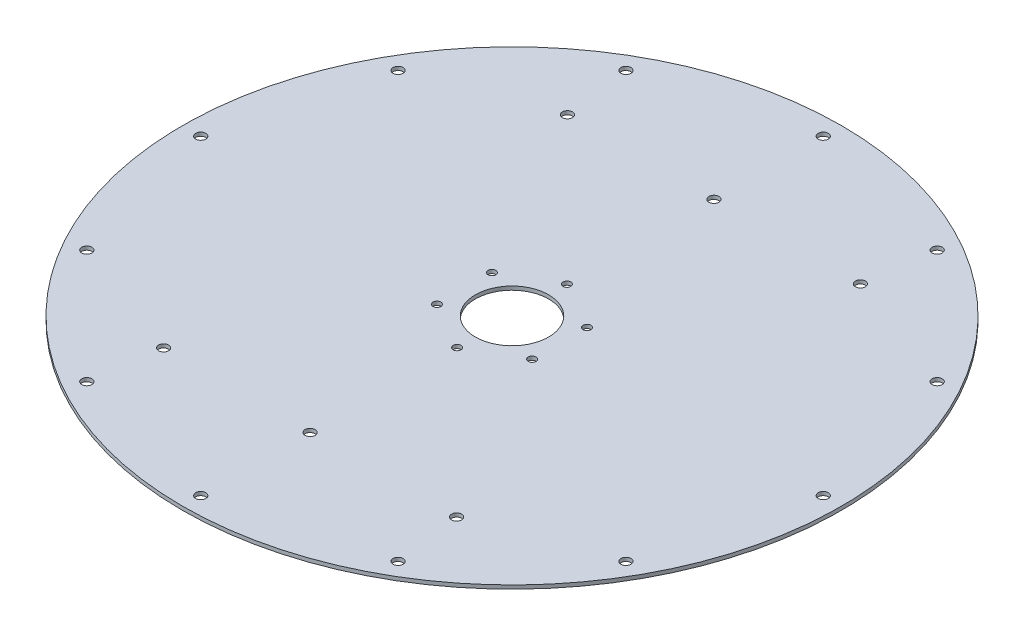
ISO-10303-21;
HEADER;
FILE_DESCRIPTION(('STEP AP214'),'2;1');
FILE_NAME('part.step','',(''),(''),'','','');
FILE_SCHEMA(('AUTOMOTIVE_DESIGN { 1 0 10303 214 1 1 1 1 }'));
ENDSEC;
DATA;
#1=APPLICATION_CONTEXT('core data for automotive mechanical design processes');
#2=APPLICATION_PROTOCOL_DEFINITION('international standard','automotive_design',2000,#1);
#3=PRODUCT_CONTEXT('',#1,'mechanical');
#4=PRODUCT('Part','Part','',(#3));
#5=PRODUCT_RELATED_PRODUCT_CATEGORY('part','',(#4));
#6=PRODUCT_DEFINITION_FORMATION('','',#4);
#7=PRODUCT_DEFINITION_CONTEXT('part definition',#1,'design');
#8=PRODUCT_DEFINITION('design','',#6,#7);
#9=PRODUCT_DEFINITION_SHAPE('','',#8);
#10=(LENGTH_UNIT() NAMED_UNIT(*) SI_UNIT(.MILLI.,.METRE.));
#11=(NAMED_UNIT(*) PLANE_ANGLE_UNIT() SI_UNIT($,.RADIAN.));
#12=(NAMED_UNIT(*) SI_UNIT($,.STERADIAN.) SOLID_ANGLE_UNIT());
#13=UNCERTAINTY_MEASURE_WITH_UNIT(LENGTH_MEASURE(1.E-05),#10,'distance_accuracy_value','');
#14=(GEOMETRIC_REPRESENTATION_CONTEXT(3) GLOBAL_UNCERTAINTY_ASSIGNED_CONTEXT((#13)) GLOBAL_UNIT_ASSIGNED_CONTEXT((#10,
#11,#12)) REPRESENTATION_CONTEXT('',''));
#15=CARTESIAN_POINT('',(0.,0.,0.));
#16=DIRECTION('',(0.,0.,1.));
#17=DIRECTION('',(1.,0.,0.));
#18=AXIS2_PLACEMENT_3D('',#15,#16,#17);
#19=CARTESIAN_POINT('',(0.,3265.99999999999,0.));
#20=DIRECTION('',(0.,1.,0.));
#21=DIRECTION('',(0.,0.,1.));
#22=AXIS2_PLACEMENT_3D('',#19,#20,#21);
#23=PLANE('',#22);
#24=CARTESIAN_POINT('',(-51.9615242270663,3265.99999999999,-30.));
#25=DIRECTION('',(0.,1.,0.));
#26=DIRECTION('',(0.,0.,1.));
#27=AXIS2_PLACEMENT_3D('',#24,#25,#26);
#28=CIRCLE('',#27,4.25);
#29=CARTESIAN_POINT('',(-51.9615242270663,3265.99999999999,-25.75));
#30=VERTEX_POINT('',#29);
#31=EDGE_CURVE('E125',#30,#30,#28,.T.);
#32=ORIENTED_EDGE('',*,*,#31,.F.);
#33=EDGE_LOOP('',(#32));
#34=FACE_BOUND('',#33,.T.);
#35=CARTESIAN_POINT('',(-51.9615242270663,3265.99999999999,30.));
#36=DIRECTION('',(0.,1.,0.));
#37=DIRECTION('',(0.,0.,1.));
#38=AXIS2_PLACEMENT_3D('',#35,#36,#37);
#39=CIRCLE('',#38,4.25);
#40=CARTESIAN_POINT('',(-51.9615242270663,3265.99999999999,34.25));
#41=VERTEX_POINT('',#40);
#42=EDGE_CURVE('E115',#41,#41,#39,.T.);
#43=ORIENTED_EDGE('',*,*,#42,.F.);
#44=EDGE_LOOP('',(#43));
#45=FACE_BOUND('',#44,.T.);
#46=CARTESIAN_POINT('',(0.,3265.99999999999,60.));
#47=DIRECTION('',(0.,1.,0.));
#48=DIRECTION('',(0.,0.,1.));
#49=AXIS2_PLACEMENT_3D('',#46,#47,#48);
#50=CIRCLE('',#49,4.25);
#51=CARTESIAN_POINT('',(0.,3265.99999999999,64.25));
#52=VERTEX_POINT('',#51);
#53=EDGE_CURVE('E112',#52,#52,#50,.T.);
#54=ORIENTED_EDGE('',*,*,#53,.F.);
#55=EDGE_LOOP('',(#54));
#56=FACE_BOUND('',#55,.T.);
#57=CARTESIAN_POINT('',(51.9615242270663,3265.99999999999,30.));
#58=DIRECTION('',(0.,1.,0.));
#59=DIRECTION('',(0.,0.,1.));
#60=AXIS2_PLACEMENT_3D('',#57,#58,#59);
#61=CIRCLE('',#60,4.25);
#62=CARTESIAN_POINT('',(51.9615242270663,3265.99999999999,34.25));
#63=VERTEX_POINT('',#62);
#64=EDGE_CURVE('E109',#63,#63,#61,.T.);
#65=ORIENTED_EDGE('',*,*,#64,.F.);
#66=EDGE_LOOP('',(#65));
#67=FACE_BOUND('',#66,.T.);
#68=CARTESIAN_POINT('',(51.9615242270663,3265.99999999999,-30.));
#69=DIRECTION('',(0.,1.,0.));
#70=DIRECTION('',(0.,0.,1.));
#71=AXIS2_PLACEMENT_3D('',#68,#69,#70);
#72=CIRCLE('',#71,4.25);
#73=CARTESIAN_POINT('',(51.9615242270663,3265.99999999999,-25.75));
#74=VERTEX_POINT('',#73);
#75=EDGE_CURVE('E105',#74,#74,#72,.T.);
#76=ORIENTED_EDGE('',*,*,#75,.F.);
#77=EDGE_LOOP('',(#76));
#78=FACE_BOUND('',#77,.T.);
#79=CARTESIAN_POINT('',(0.,3265.99999999999,-60.));
#80=DIRECTION('',(0.,1.,0.));
#81=DIRECTION('',(0.,0.,1.));
#82=AXIS2_PLACEMENT_3D('',#79,#80,#81);
#83=CIRCLE('',#82,4.25);
#84=CARTESIAN_POINT('',(0.,3265.99999999999,-55.75));
#85=VERTEX_POINT('',#84);
#86=EDGE_CURVE('E101',#85,#85,#83,.T.);
#87=ORIENTED_EDGE('',*,*,#86,.F.);
#88=EDGE_LOOP('',(#87));
#89=FACE_BOUND('',#88,.T.);
#90=CARTESIAN_POINT('',(0.,3265.99999999999,0.));
#91=DIRECTION('',(0.,1.,0.));
#92=DIRECTION('',(0.,0.,1.));
#93=AXIS2_PLACEMENT_3D('',#90,#91,#92);
#94=CIRCLE('',#93,40.);
#95=CARTESIAN_POINT('',(0.,3265.99999999999,40.));
#96=VERTEX_POINT('',#95);
#97=EDGE_CURVE('E97',#96,#96,#94,.T.);
#98=ORIENTED_EDGE('',*,*,#97,.F.);
#99=EDGE_LOOP('',(#98));
#100=FACE_BOUND('',#99,.T.);
#101=CARTESIAN_POINT('',(-160.,3265.99999999999,220.54150764194));
#102=DIRECTION('',(0.,1.,0.));
#103=DIRECTION('',(0.,0.,1.));
#104=AXIS2_PLACEMENT_3D('',#101,#102,#103);
#105=CIRCLE('',#104,5.50000000000002);
#106=CARTESIAN_POINT('',(-160.,3265.99999999999,226.04150764194));
#107=VERTEX_POINT('',#106);
#108=EDGE_CURVE('E94',#107,#107,#105,.T.);
#109=ORIENTED_EDGE('',*,*,#108,.F.);
#110=EDGE_LOOP('',(#109));
#111=FACE_BOUND('',#110,.T.);
#112=CARTESIAN_POINT('',(0.,3265.99999999999,220.54150764194));
#113=DIRECTION('',(0.,1.,0.));
#114=DIRECTION('',(0.,0.,1.));
#115=AXIS2_PLACEMENT_3D('',#112,#113,#114);
#116=CIRCLE('',#115,5.5);
#117=CARTESIAN_POINT('',(0.,3265.99999999999,226.04150764194));
#118=VERTEX_POINT('',#117);
#119=EDGE_CURVE('E90',#118,#118,#116,.T.);
#120=ORIENTED_EDGE('',*,*,#119,.F.);
#121=EDGE_LOOP('',(#120));
#122=FACE_BOUND('',#121,.T.);
#123=CARTESIAN_POINT('',(160.,3265.99999999999,220.54150764194));
#124=DIRECTION('',(0.,1.,0.));
#125=DIRECTION('',(0.,0.,1.));
#126=AXIS2_PLACEMENT_3D('',#123,#124,#125);
#127=CIRCLE('',#126,5.50000000000002);
#128=CARTESIAN_POINT('',(160.,3265.99999999999,226.04150764194));
#129=VERTEX_POINT('',#128);
#130=EDGE_CURVE('E86',#129,#129,#127,.T.);
#131=ORIENTED_EDGE('',*,*,#130,.F.);
#132=EDGE_LOOP('',(#131));
#133=FACE_BOUND('',#132,.T.);
#134=CARTESIAN_POINT('',(160.,3265.99999999999,-220.54150764194));
#135=DIRECTION('',(0.,1.,0.));
#136=DIRECTION('',(0.,0.,1.));
#137=AXIS2_PLACEMENT_3D('',#134,#135,#136);
#138=CIRCLE('',#137,5.50000000000002);
#139=CARTESIAN_POINT('',(160.,3265.99999999999,-215.04150764194));
#140=VERTEX_POINT('',#139);
#141=EDGE_CURVE('E82',#140,#140,#138,.T.);
#142=ORIENTED_EDGE('',*,*,#141,.F.);
#143=EDGE_LOOP('',(#142));
#144=FACE_BOUND('',#143,.T.);
#145=CARTESIAN_POINT('',(0.,3265.99999999999,-220.54150764194));
#146=DIRECTION('',(0.,1.,0.));
#147=DIRECTION('',(0.,0.,1.));
#148=AXIS2_PLACEMENT_3D('',#145,#146,#147);
#149=CIRCLE('',#148,5.5);
#150=CARTESIAN_POINT('',(0.,3265.99999999999,-215.04150764194));
#151=VERTEX_POINT('',#150);
#152=EDGE_CURVE('E78',#151,#151,#149,.T.);
#153=ORIENTED_EDGE('',*,*,#152,.F.);
#154=EDGE_LOOP('',(#153));
#155=FACE_BOUND('',#154,.T.);
#156=CARTESIAN_POINT('',(-160.,3265.99999999999,-220.54150764194));
#157=DIRECTION('',(0.,1.,0.));
#158=DIRECTION('',(0.,0.,1.));
#159=AXIS2_PLACEMENT_3D('',#156,#157,#158);
#160=CIRCLE('',#159,5.50000000000002);
#161=CARTESIAN_POINT('',(-160.,3265.99999999999,-215.04150764194));
#162=VERTEX_POINT('',#161);
#163=EDGE_CURVE('E73',#162,#162,#160,.T.);
#164=ORIENTED_EDGE('',*,*,#163,.F.);
#165=EDGE_LOOP('',(#164));
#166=FACE_BOUND('',#165,.T.);
#167=CARTESIAN_POINT('',(170.,3265.99999999999,294.448637286709));
#168=DIRECTION('',(0.,1.,0.));
#169=DIRECTION('',(0.,0.,1.));
#170=AXIS2_PLACEMENT_3D('',#167,#168,#169);
#171=CIRCLE('',#170,5.50000000000002);
#172=CARTESIAN_POINT('',(170.,3265.99999999999,299.948637286709));
#173=VERTEX_POINT('',#172);
#174=EDGE_CURVE('E155',#173,#173,#171,.T.);
#175=ORIENTED_EDGE('',*,*,#174,.F.);
#176=EDGE_LOOP('',(#175));
#177=FACE_BOUND('',#176,.T.);
#178=CARTESIAN_POINT('',(-170.,3265.99999999999,294.448637286709));
#179=DIRECTION('',(0.,1.,0.));
#180=DIRECTION('',(0.,0.,1.));
#181=AXIS2_PLACEMENT_3D('',#178,#179,#180);
#182=CIRCLE('',#181,5.50000000000002);
#183=CARTESIAN_POINT('',(-170.,3265.99999999999,299.948637286709));
#184=VERTEX_POINT('',#183);
#185=EDGE_CURVE('E167',#184,#184,#182,.T.);
#186=ORIENTED_EDGE('',*,*,#185,.F.);
#187=EDGE_LOOP('',(#186));
#188=FACE_BOUND('',#187,.T.);
#189=CARTESIAN_POINT('',(-340.,3265.99999999999,0.));
#190=DIRECTION('',(0.,1.,0.));
#191=DIRECTION('',(0.,0.,1.));
#192=AXIS2_PLACEMENT_3D('',#189,#190,#191);
#193=CIRCLE('',#192,5.50000000000002);
#194=CARTESIAN_POINT('',(-340.,3265.99999999999,5.50000000000008));
#195=VERTEX_POINT('',#194);
#196=EDGE_CURVE('E179',#195,#195,#193,.T.);
#197=ORIENTED_EDGE('',*,*,#196,.F.);
#198=EDGE_LOOP('',(#197));
#199=FACE_BOUND('',#198,.T.);
#200=CARTESIAN_POINT('',(-170.,3265.99999999999,-294.448637286709));
#201=DIRECTION('',(0.,1.,0.));
#202=DIRECTION('',(0.,0.,1.));
#203=AXIS2_PLACEMENT_3D('',#200,#201,#202);
#204=CIRCLE('',#203,5.50000000000002);
#205=CARTESIAN_POINT('',(-170.,3265.99999999999,-288.948637286709));
#206=VERTEX_POINT('',#205);
#207=EDGE_CURVE('E191',#206,#206,#204,.T.);
#208=ORIENTED_EDGE('',*,*,#207,.F.);
#209=EDGE_LOOP('',(#208));
#210=FACE_BOUND('',#209,.T.);
#211=CARTESIAN_POINT('',(170.,3265.99999999999,-294.448637286709));
#212=DIRECTION('',(0.,1.,0.));
#213=DIRECTION('',(0.,0.,1.));
#214=AXIS2_PLACEMENT_3D('',#211,#212,#213);
#215=CIRCLE('',#214,5.50000000000002);
#216=CARTESIAN_POINT('',(170.,3265.99999999999,-288.948637286709));
#217=VERTEX_POINT('',#216);
#218=EDGE_CURVE('E203',#217,#217,#215,.T.);
#219=ORIENTED_EDGE('',*,*,#218,.F.);
#220=EDGE_LOOP('',(#219));
#221=FACE_BOUND('',#220,.T.);
#222=CARTESIAN_POINT('',(340.,3265.99999999999,0.));
#223=DIRECTION('',(0.,1.,0.));
#224=DIRECTION('',(0.,0.,1.));
#225=AXIS2_PLACEMENT_3D('',#222,#223,#224);
#226=CIRCLE('',#225,5.50000000000002);
#227=CARTESIAN_POINT('',(340.,3265.99999999999,5.5));
#228=VERTEX_POINT('',#227);
#229=EDGE_CURVE('E64',#228,#228,#226,.T.);
#230=ORIENTED_EDGE('',*,*,#229,.F.);
#231=EDGE_LOOP('',(#230));
#232=FACE_BOUND('',#231,.T.);
#233=CARTESIAN_POINT('',(0.,3265.99999999999,0.));
#234=DIRECTION('',(0.,1.,0.));
#235=DIRECTION('',(0.,0.,1.));
#236=AXIS2_PLACEMENT_3D('',#233,#234,#235);
#237=CIRCLE('',#236,360.);
#238=CARTESIAN_POINT('',(0.,3265.99999999999,360.));
#239=VERTEX_POINT('',#238);
#240=EDGE_CURVE('E12',#239,#239,#237,.T.);
#241=ORIENTED_EDGE('',*,*,#240,.T.);
#242=EDGE_LOOP('',(#241));
#243=FACE_BOUND('',#242,.T.);
#244=CARTESIAN_POINT('',(294.448637286709,3265.99999999999,-170.));
#245=DIRECTION('',(0.,1.,0.));
#246=DIRECTION('',(0.,0.,1.));
#247=AXIS2_PLACEMENT_3D('',#244,#245,#246);
#248=CIRCLE('',#247,5.50000000000002);
#249=CARTESIAN_POINT('',(294.448637286709,3265.99999999999,-164.5));
#250=VERTEX_POINT('',#249);
#251=EDGE_CURVE('E209',#250,#250,#248,.T.);
#252=ORIENTED_EDGE('',*,*,#251,.F.);
#253=EDGE_LOOP('',(#252));
#254=FACE_BOUND('',#253,.T.);
#255=CARTESIAN_POINT('',(0.,3265.99999999999,-340.));
#256=DIRECTION('',(0.,1.,0.));
#257=DIRECTION('',(0.,0.,1.));
#258=AXIS2_PLACEMENT_3D('',#255,#256,#257);
#259=CIRCLE('',#258,5.5);
#260=CARTESIAN_POINT('',(0.,3265.99999999999,-334.5));
#261=VERTEX_POINT('',#260);
#262=EDGE_CURVE('E197',#261,#261,#259,.T.);
#263=ORIENTED_EDGE('',*,*,#262,.F.);
#264=EDGE_LOOP('',(#263));
#265=FACE_BOUND('',#264,.T.);
#266=CARTESIAN_POINT('',(-294.448637286709,3265.99999999999,-170.));
#267=DIRECTION('',(0.,1.,0.));
#268=DIRECTION('',(0.,0.,1.));
#269=AXIS2_PLACEMENT_3D('',#266,#267,#268);
#270=CIRCLE('',#269,5.49999999999996);
#271=CARTESIAN_POINT('',(-294.448637286709,3265.99999999999,-164.5));
#272=VERTEX_POINT('',#271);
#273=EDGE_CURVE('E185',#272,#272,#270,.T.);
#274=ORIENTED_EDGE('',*,*,#273,.F.);
#275=EDGE_LOOP('',(#274));
#276=FACE_BOUND('',#275,.T.);
#277=CARTESIAN_POINT('',(-294.448637286709,3265.99999999999,170.));
#278=DIRECTION('',(0.,1.,0.));
#279=DIRECTION('',(0.,0.,1.));
#280=AXIS2_PLACEMENT_3D('',#277,#278,#279);
#281=CIRCLE('',#280,5.50000000000007);
#282=CARTESIAN_POINT('',(-294.448637286709,3265.99999999999,175.5));
#283=VERTEX_POINT('',#282);
#284=EDGE_CURVE('E173',#283,#283,#281,.T.);
#285=ORIENTED_EDGE('',*,*,#284,.F.);
#286=EDGE_LOOP('',(#285));
#287=FACE_BOUND('',#286,.T.);
#288=CARTESIAN_POINT('',(0.,3265.99999999999,340.));
#289=DIRECTION('',(0.,1.,0.));
#290=DIRECTION('',(0.,0.,1.));
#291=AXIS2_PLACEMENT_3D('',#288,#289,#290);
#292=CIRCLE('',#291,5.5);
#293=CARTESIAN_POINT('',(0.,3265.99999999999,345.5));
#294=VERTEX_POINT('',#293);
#295=EDGE_CURVE('E161',#294,#294,#292,.T.);
#296=ORIENTED_EDGE('',*,*,#295,.F.);
#297=EDGE_LOOP('',(#296));
#298=FACE_BOUND('',#297,.T.);
#299=CARTESIAN_POINT('',(294.448637286709,3265.99999999999,170.));
#300=DIRECTION('',(0.,1.,0.));
#301=DIRECTION('',(0.,0.,1.));
#302=AXIS2_PLACEMENT_3D('',#299,#300,#301);
#303=CIRCLE('',#302,5.50000000000007);
#304=CARTESIAN_POINT('',(294.448637286709,3265.99999999999,175.5));
#305=VERTEX_POINT('',#304);
#306=EDGE_CURVE('E149',#305,#305,#303,.T.);
#307=ORIENTED_EDGE('',*,*,#306,.F.);
#308=EDGE_LOOP('',(#307));
#309=FACE_BOUND('',#308,.T.);
#310=ADVANCED_FACE('F51',(#34,#45,#56,#67,#78,#89,#100,#111,#122,#133,#144,#155,#166,#177,#188,
#199,#210,#221,#232,#243,#254,#265,#276,#287,#298,#309),#23,.T.);
#311=CARTESIAN_POINT('',(0.,3261.99999999999,0.));
#312=DIRECTION('',(0.,1.,0.));
#313=DIRECTION('',(0.,0.,1.));
#314=AXIS2_PLACEMENT_3D('',#311,#312,#313);
#315=PLANE('',#314);
#316=CARTESIAN_POINT('',(-51.9615242270663,3261.99999999999,-30.));
#317=DIRECTION('',(0.,1.,0.));
#318=DIRECTION('',(0.,0.,1.));
#319=AXIS2_PLACEMENT_3D('',#316,#317,#318);
#320=CIRCLE('',#319,4.25);
#321=CARTESIAN_POINT('',(-51.9615242270663,3261.99999999999,-25.75));
#322=VERTEX_POINT('',#321);
#323=EDGE_CURVE('E55',#322,#322,#320,.T.);
#324=ORIENTED_EDGE('',*,*,#323,.T.);
#325=EDGE_LOOP('',(#324));
#326=FACE_BOUND('',#325,.T.);
#327=CARTESIAN_POINT('',(-51.9615242270663,3261.99999999999,30.));
#328=DIRECTION('',(0.,1.,0.));
#329=DIRECTION('',(0.,0.,1.));
#330=AXIS2_PLACEMENT_3D('',#327,#328,#329);
#331=CIRCLE('',#330,4.25);
#332=CARTESIAN_POINT('',(-51.9615242270663,3261.99999999999,34.25));
#333=VERTEX_POINT('',#332);
#334=EDGE_CURVE('E113',#333,#333,#331,.T.);
#335=ORIENTED_EDGE('',*,*,#334,.T.);
#336=EDGE_LOOP('',(#335));
#337=FACE_BOUND('',#336,.T.);
#338=CARTESIAN_POINT('',(0.,3261.99999999999,60.));
#339=DIRECTION('',(0.,1.,0.));
#340=DIRECTION('',(0.,0.,1.));
#341=AXIS2_PLACEMENT_3D('',#338,#339,#340);
#342=CIRCLE('',#341,4.25);
#343=CARTESIAN_POINT('',(0.,3261.99999999999,64.25));
#344=VERTEX_POINT('',#343);
#345=EDGE_CURVE('E110',#344,#344,#342,.T.);
#346=ORIENTED_EDGE('',*,*,#345,.T.);
#347=EDGE_LOOP('',(#346));
#348=FACE_BOUND('',#347,.T.);
#349=CARTESIAN_POINT('',(51.9615242270663,3261.99999999999,30.));
#350=DIRECTION('',(0.,1.,0.));
#351=DIRECTION('',(0.,0.,1.));
#352=AXIS2_PLACEMENT_3D('',#349,#350,#351);
#353=CIRCLE('',#352,4.25);
#354=CARTESIAN_POINT('',(51.9615242270663,3261.99999999999,34.25));
#355=VERTEX_POINT('',#354);
#356=EDGE_CURVE('E106',#355,#355,#353,.T.);
#357=ORIENTED_EDGE('',*,*,#356,.T.);
#358=EDGE_LOOP('',(#357));
#359=FACE_BOUND('',#358,.T.);
#360=CARTESIAN_POINT('',(51.9615242270663,3261.99999999999,-30.));
#361=DIRECTION('',(0.,1.,0.));
#362=DIRECTION('',(0.,0.,1.));
#363=AXIS2_PLACEMENT_3D('',#360,#361,#362);
#364=CIRCLE('',#363,4.25);
#365=CARTESIAN_POINT('',(51.9615242270663,3261.99999999999,-25.75));
#366=VERTEX_POINT('',#365);
#367=EDGE_CURVE('E102',#366,#366,#364,.T.);
#368=ORIENTED_EDGE('',*,*,#367,.T.);
#369=EDGE_LOOP('',(#368));
#370=FACE_BOUND('',#369,.T.);
#371=CARTESIAN_POINT('',(0.,3261.99999999999,-60.));
#372=DIRECTION('',(0.,1.,0.));
#373=DIRECTION('',(0.,0.,1.));
#374=AXIS2_PLACEMENT_3D('',#371,#372,#373);
#375=CIRCLE('',#374,4.25);
#376=CARTESIAN_POINT('',(0.,3261.99999999999,-55.75));
#377=VERTEX_POINT('',#376);
#378=EDGE_CURVE('E98',#377,#377,#375,.T.);
#379=ORIENTED_EDGE('',*,*,#378,.T.);
#380=EDGE_LOOP('',(#379));
#381=FACE_BOUND('',#380,.T.);
#382=CARTESIAN_POINT('',(0.,3261.99999999999,0.));
#383=DIRECTION('',(0.,1.,0.));
#384=DIRECTION('',(0.,0.,1.));
#385=AXIS2_PLACEMENT_3D('',#382,#383,#384);
#386=CIRCLE('',#385,40.);
#387=CARTESIAN_POINT('',(0.,3261.99999999999,40.));
#388=VERTEX_POINT('',#387);
#389=EDGE_CURVE('E74',#388,#388,#386,.T.);
#390=ORIENTED_EDGE('',*,*,#389,.T.);
#391=EDGE_LOOP('',(#390));
#392=FACE_BOUND('',#391,.T.);
#393=CARTESIAN_POINT('',(-160.,3261.99999999999,220.54150764194));
#394=DIRECTION('',(0.,1.,0.));
#395=DIRECTION('',(0.,0.,1.));
#396=AXIS2_PLACEMENT_3D('',#393,#394,#395);
#397=CIRCLE('',#396,5.50000000000002);
#398=CARTESIAN_POINT('',(-160.,3261.99999999999,226.04150764194));
#399=VERTEX_POINT('',#398);
#400=EDGE_CURVE('E91',#399,#399,#397,.T.);
#401=ORIENTED_EDGE('',*,*,#400,.T.);
#402=EDGE_LOOP('',(#401));
#403=FACE_BOUND('',#402,.T.);
#404=CARTESIAN_POINT('',(0.,3261.99999999999,220.54150764194));
#405=DIRECTION('',(0.,1.,0.));
#406=DIRECTION('',(0.,0.,1.));
#407=AXIS2_PLACEMENT_3D('',#404,#405,#406);
#408=CIRCLE('',#407,5.5);
#409=CARTESIAN_POINT('',(0.,3261.99999999999,226.04150764194));
#410=VERTEX_POINT('',#409);
#411=EDGE_CURVE('E87',#410,#410,#408,.T.);
#412=ORIENTED_EDGE('',*,*,#411,.T.);
#413=EDGE_LOOP('',(#412));
#414=FACE_BOUND('',#413,.T.);
#415=CARTESIAN_POINT('',(160.,3261.99999999999,220.54150764194));
#416=DIRECTION('',(0.,1.,0.));
#417=DIRECTION('',(0.,0.,1.));
#418=AXIS2_PLACEMENT_3D('',#415,#416,#417);
#419=CIRCLE('',#418,5.50000000000002);
#420=CARTESIAN_POINT('',(160.,3261.99999999999,226.04150764194));
#421=VERTEX_POINT('',#420);
#422=EDGE_CURVE('E83',#421,#421,#419,.T.);
#423=ORIENTED_EDGE('',*,*,#422,.T.);
#424=EDGE_LOOP('',(#423));
#425=FACE_BOUND('',#424,.T.);
#426=CARTESIAN_POINT('',(160.,3261.99999999999,-220.54150764194));
#427=DIRECTION('',(0.,1.,0.));
#428=DIRECTION('',(0.,0.,1.));
#429=AXIS2_PLACEMENT_3D('',#426,#427,#428);
#430=CIRCLE('',#429,5.50000000000002);
#431=CARTESIAN_POINT('',(160.,3261.99999999999,-215.04150764194));
#432=VERTEX_POINT('',#431);
#433=EDGE_CURVE('E79',#432,#432,#430,.T.);
#434=ORIENTED_EDGE('',*,*,#433,.T.);
#435=EDGE_LOOP('',(#434));
#436=FACE_BOUND('',#435,.T.);
#437=CARTESIAN_POINT('',(0.,3261.99999999999,-220.54150764194));
#438=DIRECTION('',(0.,1.,0.));
#439=DIRECTION('',(0.,0.,1.));
#440=AXIS2_PLACEMENT_3D('',#437,#438,#439);
#441=CIRCLE('',#440,5.5);
#442=CARTESIAN_POINT('',(0.,3261.99999999999,-215.04150764194));
#443=VERTEX_POINT('',#442);
#444=EDGE_CURVE('E75',#443,#443,#441,.T.);
#445=ORIENTED_EDGE('',*,*,#444,.T.);
#446=EDGE_LOOP('',(#445));
#447=FACE_BOUND('',#446,.T.);
#448=CARTESIAN_POINT('',(-160.,3261.99999999999,-220.54150764194));
#449=DIRECTION('',(0.,1.,0.));
#450=DIRECTION('',(0.,0.,1.));
#451=AXIS2_PLACEMENT_3D('',#448,#449,#450);
#452=CIRCLE('',#451,5.50000000000002);
#453=CARTESIAN_POINT('',(-160.,3261.99999999999,-215.04150764194));
#454=VERTEX_POINT('',#453);
#455=EDGE_CURVE('E70',#454,#454,#452,.T.);
#456=ORIENTED_EDGE('',*,*,#455,.T.);
#457=EDGE_LOOP('',(#456));
#458=FACE_BOUND('',#457,.T.);
#459=CARTESIAN_POINT('',(0.,3261.99999999999,0.));
#460=DIRECTION('',(0.,1.,0.));
#461=DIRECTION('',(0.,0.,1.));
#462=AXIS2_PLACEMENT_3D('',#459,#460,#461);
#463=CIRCLE('',#462,360.);
#464=CARTESIAN_POINT('',(0.,3261.99999999999,360.));
#465=VERTEX_POINT('',#464);
#466=EDGE_CURVE('E59',#465,#465,#463,.T.);
#467=ORIENTED_EDGE('',*,*,#466,.F.);
#468=EDGE_LOOP('',(#467));
#469=FACE_BOUND('',#468,.T.);
#470=CARTESIAN_POINT('',(340.,3261.99999999999,0.));
#471=DIRECTION('',(0.,1.,0.));
#472=DIRECTION('',(0.,0.,1.));
#473=AXIS2_PLACEMENT_3D('',#470,#471,#472);
#474=CIRCLE('',#473,5.50000000000002);
#475=CARTESIAN_POINT('',(340.,3261.99999999999,5.5));
#476=VERTEX_POINT('',#475);
#477=EDGE_CURVE('E67',#476,#476,#474,.T.);
#478=ORIENTED_EDGE('',*,*,#477,.T.);
#479=EDGE_LOOP('',(#478));
#480=FACE_BOUND('',#479,.T.);
#481=CARTESIAN_POINT('',(294.448637286709,3261.99999999999,-170.));
#482=DIRECTION('',(0.,1.,0.));
#483=DIRECTION('',(0.,0.,1.));
#484=AXIS2_PLACEMENT_3D('',#481,#482,#483);
#485=CIRCLE('',#484,5.50000000000002);
#486=CARTESIAN_POINT('',(294.448637286709,3261.99999999999,-164.5));
#487=VERTEX_POINT('',#486);
#488=EDGE_CURVE('E206',#487,#487,#485,.T.);
#489=ORIENTED_EDGE('',*,*,#488,.T.);
#490=EDGE_LOOP('',(#489));
#491=FACE_BOUND('',#490,.T.);
#492=CARTESIAN_POINT('',(170.,3261.99999999999,-294.448637286709));
#493=DIRECTION('',(0.,1.,0.));
#494=DIRECTION('',(0.,0.,1.));
#495=AXIS2_PLACEMENT_3D('',#492,#493,#494);
#496=CIRCLE('',#495,5.50000000000002);
#497=CARTESIAN_POINT('',(170.,3261.99999999999,-288.948637286709));
#498=VERTEX_POINT('',#497);
#499=EDGE_CURVE('E200',#498,#498,#496,.T.);
#500=ORIENTED_EDGE('',*,*,#499,.T.);
#501=EDGE_LOOP('',(#500));
#502=FACE_BOUND('',#501,.T.);
#503=CARTESIAN_POINT('',(0.,3261.99999999999,-340.));
#504=DIRECTION('',(0.,1.,0.));
#505=DIRECTION('',(0.,0.,1.));
#506=AXIS2_PLACEMENT_3D('',#503,#504,#505);
#507=CIRCLE('',#506,5.5);
#508=CARTESIAN_POINT('',(0.,3261.99999999999,-334.5));
#509=VERTEX_POINT('',#508);
#510=EDGE_CURVE('E194',#509,#509,#507,.T.);
#511=ORIENTED_EDGE('',*,*,#510,.T.);
#512=EDGE_LOOP('',(#511));
#513=FACE_BOUND('',#512,.T.);
#514=CARTESIAN_POINT('',(-170.,3261.99999999999,-294.448637286709));
#515=DIRECTION('',(0.,1.,0.));
#516=DIRECTION('',(0.,0.,1.));
#517=AXIS2_PLACEMENT_3D('',#514,#515,#516);
#518=CIRCLE('',#517,5.50000000000002);
#519=CARTESIAN_POINT('',(-170.,3261.99999999999,-288.948637286709));
#520=VERTEX_POINT('',#519);
#521=EDGE_CURVE('E188',#520,#520,#518,.T.);
#522=ORIENTED_EDGE('',*,*,#521,.T.);
#523=EDGE_LOOP('',(#522));
#524=FACE_BOUND('',#523,.T.);
#525=CARTESIAN_POINT('',(-294.448637286709,3261.99999999999,-170.));
#526=DIRECTION('',(0.,1.,0.));
#527=DIRECTION('',(0.,0.,1.));
#528=AXIS2_PLACEMENT_3D('',#525,#526,#527);
#529=CIRCLE('',#528,5.49999999999996);
#530=CARTESIAN_POINT('',(-294.448637286709,3261.99999999999,-164.5));
#531=VERTEX_POINT('',#530);
#532=EDGE_CURVE('E182',#531,#531,#529,.T.);
#533=ORIENTED_EDGE('',*,*,#532,.T.);
#534=EDGE_LOOP('',(#533));
#535=FACE_BOUND('',#534,.T.);
#536=CARTESIAN_POINT('',(-340.,3261.99999999999,0.));
#537=DIRECTION('',(0.,1.,0.));
#538=DIRECTION('',(0.,0.,1.));
#539=AXIS2_PLACEMENT_3D('',#536,#537,#538);
#540=CIRCLE('',#539,5.50000000000002);
#541=CARTESIAN_POINT('',(-340.,3261.99999999999,5.50000000000008));
#542=VERTEX_POINT('',#541);
#543=EDGE_CURVE('E176',#542,#542,#540,.T.);
#544=ORIENTED_EDGE('',*,*,#543,.T.);
#545=EDGE_LOOP('',(#544));
#546=FACE_BOUND('',#545,.T.);
#547=CARTESIAN_POINT('',(-294.448637286709,3261.99999999999,170.));
#548=DIRECTION('',(0.,1.,0.));
#549=DIRECTION('',(0.,0.,1.));
#550=AXIS2_PLACEMENT_3D('',#547,#548,#549);
#551=CIRCLE('',#550,5.50000000000007);
#552=CARTESIAN_POINT('',(-294.448637286709,3261.99999999999,175.5));
#553=VERTEX_POINT('',#552);
#554=EDGE_CURVE('E170',#553,#553,#551,.T.);
#555=ORIENTED_EDGE('',*,*,#554,.T.);
#556=EDGE_LOOP('',(#555));
#557=FACE_BOUND('',#556,.T.);
#558=CARTESIAN_POINT('',(-170.,3261.99999999999,294.448637286709));
#559=DIRECTION('',(0.,1.,0.));
#560=DIRECTION('',(0.,0.,1.));
#561=AXIS2_PLACEMENT_3D('',#558,#559,#560);
#562=CIRCLE('',#561,5.50000000000002);
#563=CARTESIAN_POINT('',(-170.,3261.99999999999,299.948637286709));
#564=VERTEX_POINT('',#563);
#565=EDGE_CURVE('E164',#564,#564,#562,.T.);
#566=ORIENTED_EDGE('',*,*,#565,.T.);
#567=EDGE_LOOP('',(#566));
#568=FACE_BOUND('',#567,.T.);
#569=CARTESIAN_POINT('',(0.,3261.99999999999,340.));
#570=DIRECTION('',(0.,1.,0.));
#571=DIRECTION('',(0.,0.,1.));
#572=AXIS2_PLACEMENT_3D('',#569,#570,#571);
#573=CIRCLE('',#572,5.5);
#574=CARTESIAN_POINT('',(0.,3261.99999999999,345.5));
#575=VERTEX_POINT('',#574);
#576=EDGE_CURVE('E158',#575,#575,#573,.T.);
#577=ORIENTED_EDGE('',*,*,#576,.T.);
#578=EDGE_LOOP('',(#577));
#579=FACE_BOUND('',#578,.T.);
#580=CARTESIAN_POINT('',(170.,3261.99999999999,294.448637286709));
#581=DIRECTION('',(0.,1.,0.));
#582=DIRECTION('',(0.,0.,1.));
#583=AXIS2_PLACEMENT_3D('',#580,#581,#582);
#584=CIRCLE('',#583,5.50000000000002);
#585=CARTESIAN_POINT('',(170.,3261.99999999999,299.948637286709));
#586=VERTEX_POINT('',#585);
#587=EDGE_CURVE('E152',#586,#586,#584,.T.);
#588=ORIENTED_EDGE('',*,*,#587,.T.);
#589=EDGE_LOOP('',(#588));
#590=FACE_BOUND('',#589,.T.);
#591=CARTESIAN_POINT('',(294.448637286709,3261.99999999999,170.));
#592=DIRECTION('',(0.,1.,0.));
#593=DIRECTION('',(0.,0.,1.));
#594=AXIS2_PLACEMENT_3D('',#591,#592,#593);
#595=CIRCLE('',#594,5.50000000000007);
#596=CARTESIAN_POINT('',(294.448637286709,3261.99999999999,175.5));
#597=VERTEX_POINT('',#596);
#598=EDGE_CURVE('E148',#597,#597,#595,.T.);
#599=ORIENTED_EDGE('',*,*,#598,.T.);
#600=EDGE_LOOP('',(#599));
#601=FACE_BOUND('',#600,.T.);
#602=ADVANCED_FACE('F219',(#326,#337,#348,#359,#370,#381,#392,#403,#414,#425,#436,#447,#458,
#469,#480,#491,#502,#513,#524,#535,#546,#557,#568,#579,#590,#601),#315,.F.);
#603=CARTESIAN_POINT('',(0.,3265.99999999999,0.));
#604=DIRECTION('',(0.,-1.,0.));
#605=DIRECTION('',(0.,0.,-1.));
#606=AXIS2_PLACEMENT_3D('',#603,#604,#605);
#607=CYLINDRICAL_SURFACE('',#606,360.);
#608=ORIENTED_EDGE('',*,*,#240,.F.);
#609=EDGE_LOOP('',(#608));
#610=FACE_BOUND('',#609,.T.);
#611=ORIENTED_EDGE('',*,*,#466,.T.);
#612=EDGE_LOOP('',(#611));
#613=FACE_BOUND('',#612,.T.);
#614=ADVANCED_FACE('F53',(#610,#613),#607,.T.);
#615=CARTESIAN_POINT('',(340.,3265.99999999999,0.));
#616=DIRECTION('',(0.,-1.,0.));
#617=DIRECTION('',(0.,0.,-1.));
#618=AXIS2_PLACEMENT_3D('',#615,#616,#617);
#619=CYLINDRICAL_SURFACE('',#618,5.50000000000002);
#620=ORIENTED_EDGE('',*,*,#229,.T.);
#621=EDGE_LOOP('',(#620));
#622=FACE_BOUND('',#621,.T.);
#623=ORIENTED_EDGE('',*,*,#477,.F.);
#624=EDGE_LOOP('',(#623));
#625=FACE_BOUND('',#624,.T.);
#626=ADVANCED_FACE('F222',(#622,#625),#619,.F.);
#627=CARTESIAN_POINT('',(294.448637286709,3265.99999999999,-170.));
#628=DIRECTION('',(0.,-1.,0.));
#629=DIRECTION('',(0.,0.,-1.));
#630=AXIS2_PLACEMENT_3D('',#627,#628,#629);
#631=CYLINDRICAL_SURFACE('',#630,5.50000000000002);
#632=ORIENTED_EDGE('',*,*,#251,.T.);
#633=EDGE_LOOP('',(#632));
#634=FACE_BOUND('',#633,.T.);
#635=ORIENTED_EDGE('',*,*,#488,.F.);
#636=EDGE_LOOP('',(#635));
#637=FACE_BOUND('',#636,.T.);
#638=ADVANCED_FACE('F224',(#634,#637),#631,.F.);
#639=CARTESIAN_POINT('',(170.,3265.99999999999,-294.448637286709));
#640=DIRECTION('',(0.,-1.,0.));
#641=DIRECTION('',(0.,0.,-1.));
#642=AXIS2_PLACEMENT_3D('',#639,#640,#641);
#643=CYLINDRICAL_SURFACE('',#642,5.50000000000002);
#644=ORIENTED_EDGE('',*,*,#218,.T.);
#645=EDGE_LOOP('',(#644));
#646=FACE_BOUND('',#645,.T.);
#647=ORIENTED_EDGE('',*,*,#499,.F.);
#648=EDGE_LOOP('',(#647));
#649=FACE_BOUND('',#648,.T.);
#650=ADVANCED_FACE('F230',(#646,#649),#643,.F.);
#651=CARTESIAN_POINT('',(0.,3265.99999999999,-340.));
#652=DIRECTION('',(0.,-1.,0.));
#653=DIRECTION('',(0.,0.,-1.));
#654=AXIS2_PLACEMENT_3D('',#651,#652,#653);
#655=CYLINDRICAL_SURFACE('',#654,5.5);
#656=ORIENTED_EDGE('',*,*,#262,.T.);
#657=EDGE_LOOP('',(#656));
#658=FACE_BOUND('',#657,.T.);
#659=ORIENTED_EDGE('',*,*,#510,.F.);
#660=EDGE_LOOP('',(#659));
#661=FACE_BOUND('',#660,.T.);
#662=ADVANCED_FACE('F332',(#658,#661),#655,.F.);
#663=CARTESIAN_POINT('',(-170.,3265.99999999999,-294.448637286709));
#664=DIRECTION('',(0.,-1.,0.));
#665=DIRECTION('',(0.,0.,-1.));
#666=AXIS2_PLACEMENT_3D('',#663,#664,#665);
#667=CYLINDRICAL_SURFACE('',#666,5.50000000000002);
#668=ORIENTED_EDGE('',*,*,#207,.T.);
#669=EDGE_LOOP('',(#668));
#670=FACE_BOUND('',#669,.T.);
#671=ORIENTED_EDGE('',*,*,#521,.F.);
#672=EDGE_LOOP('',(#671));
#673=FACE_BOUND('',#672,.T.);
#674=ADVANCED_FACE('F328',(#670,#673),#667,.F.);
#675=CARTESIAN_POINT('',(-294.448637286709,3265.99999999999,-170.));
#676=DIRECTION('',(0.,-1.,0.));
#677=DIRECTION('',(0.,0.,-1.));
#678=AXIS2_PLACEMENT_3D('',#675,#676,#677);
#679=CYLINDRICAL_SURFACE('',#678,5.49999999999996);
#680=ORIENTED_EDGE('',*,*,#273,.T.);
#681=EDGE_LOOP('',(#680));
#682=FACE_BOUND('',#681,.T.);
#683=ORIENTED_EDGE('',*,*,#532,.F.);
#684=EDGE_LOOP('',(#683));
#685=FACE_BOUND('',#684,.T.);
#686=ADVANCED_FACE('F324',(#682,#685),#679,.F.);
#687=CARTESIAN_POINT('',(-340.,3265.99999999999,0.));
#688=DIRECTION('',(0.,-1.,0.));
#689=DIRECTION('',(0.,0.,-1.));
#690=AXIS2_PLACEMENT_3D('',#687,#688,#689);
#691=CYLINDRICAL_SURFACE('',#690,5.50000000000002);
#692=ORIENTED_EDGE('',*,*,#196,.T.);
#693=EDGE_LOOP('',(#692));
#694=FACE_BOUND('',#693,.T.);
#695=ORIENTED_EDGE('',*,*,#543,.F.);
#696=EDGE_LOOP('',(#695));
#697=FACE_BOUND('',#696,.T.);
#698=ADVANCED_FACE('F320',(#694,#697),#691,.F.);
#699=CARTESIAN_POINT('',(-294.448637286709,3265.99999999999,170.));
#700=DIRECTION('',(0.,-1.,0.));
#701=DIRECTION('',(0.,0.,-1.));
#702=AXIS2_PLACEMENT_3D('',#699,#700,#701);
#703=CYLINDRICAL_SURFACE('',#702,5.50000000000007);
#704=ORIENTED_EDGE('',*,*,#284,.T.);
#705=EDGE_LOOP('',(#704));
#706=FACE_BOUND('',#705,.T.);
#707=ORIENTED_EDGE('',*,*,#554,.F.);
#708=EDGE_LOOP('',(#707));
#709=FACE_BOUND('',#708,.T.);
#710=ADVANCED_FACE('F316',(#706,#709),#703,.F.);
#711=CARTESIAN_POINT('',(-170.,3265.99999999999,294.448637286709));
#712=DIRECTION('',(0.,-1.,0.));
#713=DIRECTION('',(0.,0.,-1.));
#714=AXIS2_PLACEMENT_3D('',#711,#712,#713);
#715=CYLINDRICAL_SURFACE('',#714,5.50000000000002);
#716=ORIENTED_EDGE('',*,*,#185,.T.);
#717=EDGE_LOOP('',(#716));
#718=FACE_BOUND('',#717,.T.);
#719=ORIENTED_EDGE('',*,*,#565,.F.);
#720=EDGE_LOOP('',(#719));
#721=FACE_BOUND('',#720,.T.);
#722=ADVANCED_FACE('F312',(#718,#721),#715,.F.);
#723=CARTESIAN_POINT('',(0.,3265.99999999999,340.));
#724=DIRECTION('',(0.,-1.,0.));
#725=DIRECTION('',(0.,0.,-1.));
#726=AXIS2_PLACEMENT_3D('',#723,#724,#725);
#727=CYLINDRICAL_SURFACE('',#726,5.5);
#728=ORIENTED_EDGE('',*,*,#295,.T.);
#729=EDGE_LOOP('',(#728));
#730=FACE_BOUND('',#729,.T.);
#731=ORIENTED_EDGE('',*,*,#576,.F.);
#732=EDGE_LOOP('',(#731));
#733=FACE_BOUND('',#732,.T.);
#734=ADVANCED_FACE('F305',(#730,#733),#727,.F.);
#735=CARTESIAN_POINT('',(170.,3265.99999999999,294.448637286709));
#736=DIRECTION('',(0.,-1.,0.));
#737=DIRECTION('',(0.,0.,-1.));
#738=AXIS2_PLACEMENT_3D('',#735,#736,#737);
#739=CYLINDRICAL_SURFACE('',#738,5.50000000000002);
#740=ORIENTED_EDGE('',*,*,#174,.T.);
#741=EDGE_LOOP('',(#740));
#742=FACE_BOUND('',#741,.T.);
#743=ORIENTED_EDGE('',*,*,#587,.F.);
#744=EDGE_LOOP('',(#743));
#745=FACE_BOUND('',#744,.T.);
#746=ADVANCED_FACE('F294',(#742,#745),#739,.F.);
#747=CARTESIAN_POINT('',(294.448637286709,3265.99999999999,170.));
#748=DIRECTION('',(0.,-1.,0.));
#749=DIRECTION('',(0.,0.,-1.));
#750=AXIS2_PLACEMENT_3D('',#747,#748,#749);
#751=CYLINDRICAL_SURFACE('',#750,5.50000000000007);
#752=ORIENTED_EDGE('',*,*,#306,.T.);
#753=EDGE_LOOP('',(#752));
#754=FACE_BOUND('',#753,.T.);
#755=ORIENTED_EDGE('',*,*,#598,.F.);
#756=EDGE_LOOP('',(#755));
#757=FACE_BOUND('',#756,.T.);
#758=ADVANCED_FACE('F290',(#754,#757),#751,.F.);
#759=CARTESIAN_POINT('',(-160.,3259.99999999999,-220.54150764194));
#760=DIRECTION('',(0.,1.,0.));
#761=DIRECTION('',(0.,0.,1.));
#762=AXIS2_PLACEMENT_3D('',#759,#760,#761);
#763=CYLINDRICAL_SURFACE('',#762,5.50000000000002);
#764=ORIENTED_EDGE('',*,*,#163,.T.);
#765=EDGE_LOOP('',(#764));
#766=FACE_BOUND('',#765,.T.);
#767=ORIENTED_EDGE('',*,*,#455,.F.);
#768=EDGE_LOOP('',(#767));
#769=FACE_BOUND('',#768,.T.);
#770=ADVANCED_FACE('F293',(#766,#769),#763,.F.);
#771=CARTESIAN_POINT('',(0.,3259.99999999999,-220.54150764194));
#772=DIRECTION('',(0.,1.,0.));
#773=DIRECTION('',(0.,0.,1.));
#774=AXIS2_PLACEMENT_3D('',#771,#772,#773);
#775=CYLINDRICAL_SURFACE('',#774,5.5);
#776=ORIENTED_EDGE('',*,*,#152,.T.);
#777=EDGE_LOOP('',(#776));
#778=FACE_BOUND('',#777,.T.);
#779=ORIENTED_EDGE('',*,*,#444,.F.);
#780=EDGE_LOOP('',(#779));
#781=FACE_BOUND('',#780,.T.);
#782=ADVANCED_FACE('F302',(#778,#781),#775,.F.);
#783=CARTESIAN_POINT('',(160.,3259.99999999999,-220.54150764194));
#784=DIRECTION('',(0.,1.,0.));
#785=DIRECTION('',(0.,0.,1.));
#786=AXIS2_PLACEMENT_3D('',#783,#784,#785);
#787=CYLINDRICAL_SURFACE('',#786,5.50000000000002);
#788=ORIENTED_EDGE('',*,*,#141,.T.);
#789=EDGE_LOOP('',(#788));
#790=FACE_BOUND('',#789,.T.);
#791=ORIENTED_EDGE('',*,*,#433,.F.);
#792=EDGE_LOOP('',(#791));
#793=FACE_BOUND('',#792,.T.);
#794=ADVANCED_FACE('F431',(#790,#793),#787,.F.);
#795=CARTESIAN_POINT('',(160.,3259.99999999999,220.54150764194));
#796=DIRECTION('',(0.,1.,0.));
#797=DIRECTION('',(0.,0.,1.));
#798=AXIS2_PLACEMENT_3D('',#795,#796,#797);
#799=CYLINDRICAL_SURFACE('',#798,5.50000000000002);
#800=ORIENTED_EDGE('',*,*,#130,.T.);
#801=EDGE_LOOP('',(#800));
#802=FACE_BOUND('',#801,.T.);
#803=ORIENTED_EDGE('',*,*,#422,.F.);
#804=EDGE_LOOP('',(#803));
#805=FACE_BOUND('',#804,.T.);
#806=ADVANCED_FACE('F440',(#802,#805),#799,.F.);
#807=CARTESIAN_POINT('',(0.,3259.99999999999,220.54150764194));
#808=DIRECTION('',(0.,1.,0.));
#809=DIRECTION('',(0.,0.,1.));
#810=AXIS2_PLACEMENT_3D('',#807,#808,#809);
#811=CYLINDRICAL_SURFACE('',#810,5.5);
#812=ORIENTED_EDGE('',*,*,#119,.T.);
#813=EDGE_LOOP('',(#812));
#814=FACE_BOUND('',#813,.T.);
#815=ORIENTED_EDGE('',*,*,#411,.F.);
#816=EDGE_LOOP('',(#815));
#817=FACE_BOUND('',#816,.T.);
#818=ADVANCED_FACE('F450',(#814,#817),#811,.F.);
#819=CARTESIAN_POINT('',(-160.,3259.99999999999,220.54150764194));
#820=DIRECTION('',(0.,1.,0.));
#821=DIRECTION('',(0.,0.,1.));
#822=AXIS2_PLACEMENT_3D('',#819,#820,#821);
#823=CYLINDRICAL_SURFACE('',#822,5.50000000000002);
#824=ORIENTED_EDGE('',*,*,#108,.T.);
#825=EDGE_LOOP('',(#824));
#826=FACE_BOUND('',#825,.T.);
#827=ORIENTED_EDGE('',*,*,#400,.F.);
#828=EDGE_LOOP('',(#827));
#829=FACE_BOUND('',#828,.T.);
#830=ADVANCED_FACE('F460',(#826,#829),#823,.F.);
#831=CARTESIAN_POINT('',(0.,3255.99999999999,0.));
#832=DIRECTION('',(0.,1.,0.));
#833=DIRECTION('',(0.,0.,1.));
#834=AXIS2_PLACEMENT_3D('',#831,#832,#833);
#835=CYLINDRICAL_SURFACE('',#834,40.);
#836=ORIENTED_EDGE('',*,*,#97,.T.);
#837=EDGE_LOOP('',(#836));
#838=FACE_BOUND('',#837,.T.);
#839=ORIENTED_EDGE('',*,*,#389,.F.);
#840=EDGE_LOOP('',(#839));
#841=FACE_BOUND('',#840,.T.);
#842=ADVANCED_FACE('F470',(#838,#841),#835,.F.);
#843=CARTESIAN_POINT('',(0.,3255.99999999999,-60.));
#844=DIRECTION('',(0.,1.,0.));
#845=DIRECTION('',(0.,0.,1.));
#846=AXIS2_PLACEMENT_3D('',#843,#844,#845);
#847=CYLINDRICAL_SURFACE('',#846,4.25);
#848=ORIENTED_EDGE('',*,*,#86,.T.);
#849=EDGE_LOOP('',(#848));
#850=FACE_BOUND('',#849,.T.);
#851=ORIENTED_EDGE('',*,*,#378,.F.);
#852=EDGE_LOOP('',(#851));
#853=FACE_BOUND('',#852,.T.);
#854=ADVANCED_FACE('F480',(#850,#853),#847,.F.);
#855=CARTESIAN_POINT('',(51.9615242270663,3255.99999999999,-30.));
#856=DIRECTION('',(0.,1.,0.));
#857=DIRECTION('',(0.,0.,1.));
#858=AXIS2_PLACEMENT_3D('',#855,#856,#857);
#859=CYLINDRICAL_SURFACE('',#858,4.25);
#860=ORIENTED_EDGE('',*,*,#75,.T.);
#861=EDGE_LOOP('',(#860));
#862=FACE_BOUND('',#861,.T.);
#863=ORIENTED_EDGE('',*,*,#367,.F.);
#864=EDGE_LOOP('',(#863));
#865=FACE_BOUND('',#864,.T.);
#866=ADVANCED_FACE('F490',(#862,#865),#859,.F.);
#867=CARTESIAN_POINT('',(51.9615242270663,3255.99999999999,30.));
#868=DIRECTION('',(0.,1.,0.));
#869=DIRECTION('',(0.,0.,1.));
#870=AXIS2_PLACEMENT_3D('',#867,#868,#869);
#871=CYLINDRICAL_SURFACE('',#870,4.25);
#872=ORIENTED_EDGE('',*,*,#64,.T.);
#873=EDGE_LOOP('',(#872));
#874=FACE_BOUND('',#873,.T.);
#875=ORIENTED_EDGE('',*,*,#356,.F.);
#876=EDGE_LOOP('',(#875));
#877=FACE_BOUND('',#876,.T.);
#878=ADVANCED_FACE('F500',(#874,#877),#871,.F.);
#879=CARTESIAN_POINT('',(0.,3255.99999999999,60.));
#880=DIRECTION('',(0.,1.,0.));
#881=DIRECTION('',(0.,0.,1.));
#882=AXIS2_PLACEMENT_3D('',#879,#880,#881);
#883=CYLINDRICAL_SURFACE('',#882,4.25);
#884=ORIENTED_EDGE('',*,*,#53,.T.);
#885=EDGE_LOOP('',(#884));
#886=FACE_BOUND('',#885,.T.);
#887=ORIENTED_EDGE('',*,*,#345,.F.);
#888=EDGE_LOOP('',(#887));
#889=FACE_BOUND('',#888,.T.);
#890=ADVANCED_FACE('F510',(#886,#889),#883,.F.);
#891=CARTESIAN_POINT('',(-51.9615242270663,3255.99999999999,30.));
#892=DIRECTION('',(0.,1.,0.));
#893=DIRECTION('',(0.,0.,1.));
#894=AXIS2_PLACEMENT_3D('',#891,#892,#893);
#895=CYLINDRICAL_SURFACE('',#894,4.25);
#896=ORIENTED_EDGE('',*,*,#42,.T.);
#897=EDGE_LOOP('',(#896));
#898=FACE_BOUND('',#897,.T.);
#899=ORIENTED_EDGE('',*,*,#334,.F.);
#900=EDGE_LOOP('',(#899));
#901=FACE_BOUND('',#900,.T.);
#902=ADVANCED_FACE('F520',(#898,#901),#895,.F.);
#903=CARTESIAN_POINT('',(-51.9615242270663,3255.99999999999,-30.));
#904=DIRECTION('',(0.,1.,0.));
#905=DIRECTION('',(0.,0.,1.));
#906=AXIS2_PLACEMENT_3D('',#903,#904,#905);
#907=CYLINDRICAL_SURFACE('',#906,4.25);
#908=ORIENTED_EDGE('',*,*,#31,.T.);
#909=EDGE_LOOP('',(#908));
#910=FACE_BOUND('',#909,.T.);
#911=ORIENTED_EDGE('',*,*,#323,.F.);
#912=EDGE_LOOP('',(#911));
#913=FACE_BOUND('',#912,.T.);
#914=ADVANCED_FACE('F530',(#910,#913),#907,.F.);
#915=CLOSED_SHELL('',(#310,#602,#614,#626,#638,#650,#662,#674,#686,#698,#710,#722,#734,#746,
#758,#770,#782,#794,#806,#818,#830,#842,#854,#866,#878,#890,#902,#914));
#916=MANIFOLD_SOLID_BREP('B2',#915);
#917=ADVANCED_BREP_SHAPE_REPRESENTATION('',(#18,#916),#14);
#918=SHAPE_DEFINITION_REPRESENTATION(#9,#917);
ENDSEC;
END-ISO-10303-21;
